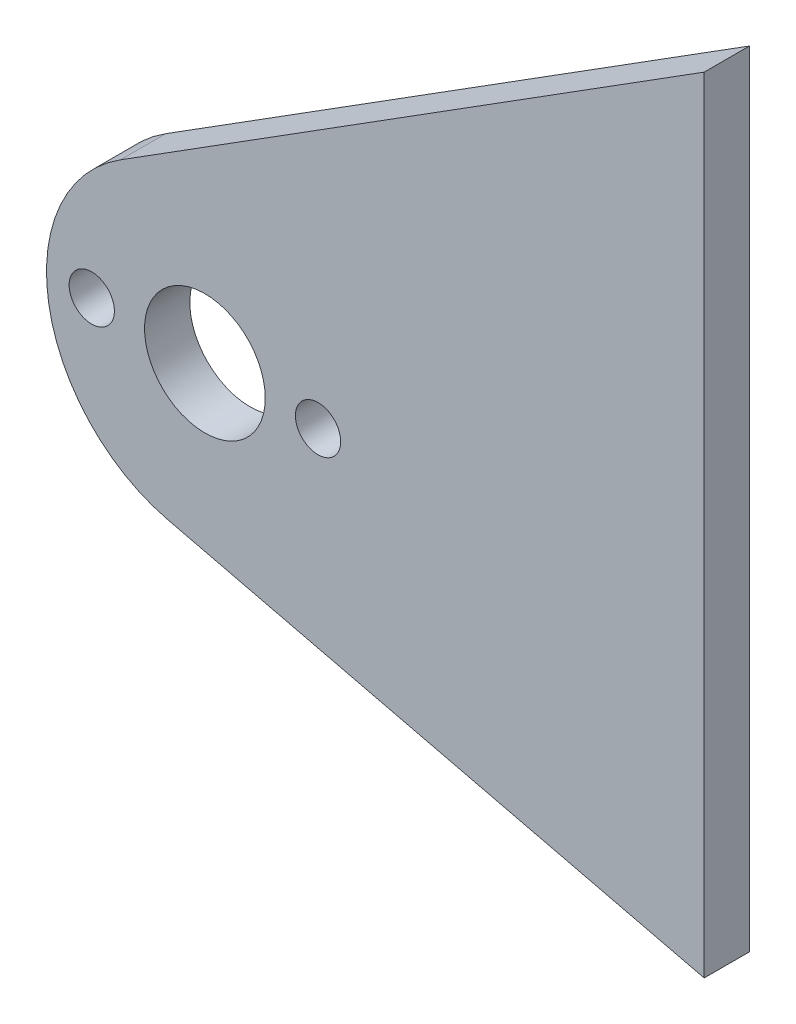
ISO-10303-21;
HEADER;
FILE_DESCRIPTION(('STEP AP214'),'2;1');
FILE_NAME('part.step','',(''),(''),'','','');
FILE_SCHEMA(('AUTOMOTIVE_DESIGN { 1 0 10303 214 1 1 1 1 }'));
ENDSEC;
DATA;
#1=APPLICATION_CONTEXT('core data for automotive mechanical design processes');
#2=APPLICATION_PROTOCOL_DEFINITION('international standard','automotive_design',2000,#1);
#3=PRODUCT_CONTEXT('',#1,'mechanical');
#4=PRODUCT('Part','Part','',(#3));
#5=PRODUCT_RELATED_PRODUCT_CATEGORY('part','',(#4));
#6=PRODUCT_DEFINITION_FORMATION('','',#4);
#7=PRODUCT_DEFINITION_CONTEXT('part definition',#1,'design');
#8=PRODUCT_DEFINITION('design','',#6,#7);
#9=PRODUCT_DEFINITION_SHAPE('','',#8);
#10=(LENGTH_UNIT() NAMED_UNIT(*) SI_UNIT(.MILLI.,.METRE.));
#11=(NAMED_UNIT(*) PLANE_ANGLE_UNIT() SI_UNIT($,.RADIAN.));
#12=(NAMED_UNIT(*) SI_UNIT($,.STERADIAN.) SOLID_ANGLE_UNIT());
#13=UNCERTAINTY_MEASURE_WITH_UNIT(LENGTH_MEASURE(1.E-05),#10,'distance_accuracy_value','');
#14=(GEOMETRIC_REPRESENTATION_CONTEXT(3) GLOBAL_UNCERTAINTY_ASSIGNED_CONTEXT((#13)) GLOBAL_UNIT_ASSIGNED_CONTEXT((#10,
#11,#12)) REPRESENTATION_CONTEXT('',''));
#15=CARTESIAN_POINT('',(0.,0.,0.));
#16=DIRECTION('',(0.,0.,1.));
#17=DIRECTION('',(1.,0.,0.));
#18=AXIS2_PLACEMENT_3D('',#15,#16,#17);
#19=CARTESIAN_POINT('',(-2.13222436464715,-8.88641442107344,3.));
#20=DIRECTION('',(-0.233319657242262,-0.972400091291827,0.));
#21=DIRECTION('',(0.972400091291827,-0.233319657242262,0.));
#22=AXIS2_PLACEMENT_3D('',#19,#20,#21);
#23=PLANE('',#22);
#24=DIRECTION('',(-0.972400091291827,0.233319657242262,0.));
#25=VECTOR('',#24,1.);
#26=CARTESIAN_POINT('',(-2.13222436464715,-8.88641442107344,0.));
#27=LINE('',#26,#25);
#28=CARTESIAN_POINT('',(33.092598,-17.33833,0.));
#29=VERTEX_POINT('',#28);
#30=CARTESIAN_POINT('',(-2.449857,-8.81020099999999,0.));
#31=VERTEX_POINT('',#30);
#32=EDGE_CURVE('E110',#29,#31,#27,.T.);
#33=ORIENTED_EDGE('',*,*,#32,.F.);
#34=DIRECTION('',(0.,0.,-1.));
#35=VECTOR('',#34,1.);
#36=CARTESIAN_POINT('',(33.092598,-17.33833,3.));
#37=LINE('',#36,#35);
#38=CARTESIAN_POINT('',(33.092598,-17.33833,3.));
#39=VERTEX_POINT('',#38);
#40=EDGE_CURVE('E11',#39,#29,#37,.T.);
#41=ORIENTED_EDGE('',*,*,#40,.F.);
#42=DIRECTION('',(-0.972400091291827,0.233319657242262,0.));
#43=VECTOR('',#42,1.);
#44=CARTESIAN_POINT('',(-2.13222436464715,-8.88641442107344,3.));
#45=LINE('',#44,#43);
#46=CARTESIAN_POINT('',(-2.449857,-8.81020099999999,3.));
#47=VERTEX_POINT('',#46);
#48=EDGE_CURVE('E94',#39,#47,#45,.T.);
#49=ORIENTED_EDGE('',*,*,#48,.T.);
#50=DIRECTION('',(0.,0.,-1.));
#51=VECTOR('',#50,1.);
#52=CARTESIAN_POINT('',(-2.449857,-8.81020099999999,3.));
#53=LINE('',#52,#51);
#54=EDGE_CURVE('E72',#47,#31,#53,.T.);
#55=ORIENTED_EDGE('',*,*,#54,.T.);
#56=EDGE_LOOP('',(#33,#41,#49,#55));
#57=FACE_BOUND('',#56,.T.);
#58=ADVANCED_FACE('F32',(#57),#23,.T.);
#59=CARTESIAN_POINT('',(33.092598,0.,3.));
#60=DIRECTION('',(1.,0.,0.));
#61=DIRECTION('',(0.,0.,-1.));
#62=AXIS2_PLACEMENT_3D('',#59,#60,#61);
#63=PLANE('',#62);
#64=DIRECTION('',(0.,-1.,0.));
#65=VECTOR('',#64,1.);
#66=CARTESIAN_POINT('',(33.092598,0.,0.));
#67=LINE('',#66,#65);
#68=CARTESIAN_POINT('',(33.092598,34.66167,0.));
#69=VERTEX_POINT('',#68);
#70=EDGE_CURVE('E84',#69,#29,#67,.T.);
#71=ORIENTED_EDGE('',*,*,#70,.F.);
#72=DIRECTION('',(0.,0.,-1.));
#73=VECTOR('',#72,1.);
#74=CARTESIAN_POINT('',(33.092598,34.66167,3.));
#75=LINE('',#74,#73);
#76=CARTESIAN_POINT('',(33.092598,34.66167,3.));
#77=VERTEX_POINT('',#76);
#78=EDGE_CURVE('E41',#77,#69,#75,.T.);
#79=ORIENTED_EDGE('',*,*,#78,.F.);
#80=DIRECTION('',(0.,-1.,0.));
#81=VECTOR('',#80,1.);
#82=CARTESIAN_POINT('',(33.092598,0.,3.));
#83=LINE('',#82,#81);
#84=EDGE_CURVE('E82',#77,#39,#83,.T.);
#85=ORIENTED_EDGE('',*,*,#84,.T.);
#86=ORIENTED_EDGE('',*,*,#40,.T.);
#87=EDGE_LOOP('',(#71,#79,#85,#86));
#88=FACE_BOUND('',#87,.T.);
#89=ADVANCED_FACE('F80',(#88),#63,.T.);
#90=CARTESIAN_POINT('',(-6.22887778180823,9.88575777058124,3.));
#91=DIRECTION('',(0.533089755805375,-0.846058693150402,0.));
#92=DIRECTION('',(0.846058693150402,0.533089755805375,0.));
#93=AXIS2_PLACEMENT_3D('',#90,#91,#92);
#94=PLANE('',#93);
#95=DIRECTION('',(-0.846058693150402,-0.533089755805375,0.));
#96=VECTOR('',#95,1.);
#97=CARTESIAN_POINT('',(-6.22887778180823,9.88575777058124,0.));
#98=LINE('',#97,#96);
#99=CARTESIAN_POINT('',(-5.59744300000001,10.283616,0.));
#100=VERTEX_POINT('',#99);
#101=EDGE_CURVE('E113',#69,#100,#98,.T.);
#102=ORIENTED_EDGE('',*,*,#101,.T.);
#103=DIRECTION('',(0.,0.,-1.));
#104=VECTOR('',#103,1.);
#105=CARTESIAN_POINT('',(-5.59744300000001,10.283616,3.));
#106=LINE('',#105,#104);
#107=CARTESIAN_POINT('',(-5.59744300000001,10.283616,3.));
#108=VERTEX_POINT('',#107);
#109=EDGE_CURVE('E87',#108,#100,#106,.T.);
#110=ORIENTED_EDGE('',*,*,#109,.F.);
#111=DIRECTION('',(-0.846058693150402,-0.533089755805375,0.));
#112=VECTOR('',#111,1.);
#113=CARTESIAN_POINT('',(-6.22887778180823,9.88575777058124,3.));
#114=LINE('',#113,#112);
#115=EDGE_CURVE('E89',#77,#108,#114,.T.);
#116=ORIENTED_EDGE('',*,*,#115,.F.);
#117=ORIENTED_EDGE('',*,*,#78,.T.);
#118=EDGE_LOOP('',(#102,#110,#116,#117));
#119=FACE_BOUND('',#118,.T.);
#120=ADVANCED_FACE('F90',(#119),#94,.F.);
#121=CARTESIAN_POINT('',(-7.50000000000001,1.39999999999998,3.));
#122=DIRECTION('',(0.,0.,-1.));
#123=DIRECTION('',(-1.,0.,0.));
#124=AXIS2_PLACEMENT_3D('',#121,#122,#123);
#125=CYLINDRICAL_SURFACE('',#124,1.5);
#126=CARTESIAN_POINT('',(-7.50000000000001,1.39999999999998,3.));
#127=DIRECTION('',(0.,0.,1.));
#128=DIRECTION('',(1.,0.,0.));
#129=AXIS2_PLACEMENT_3D('',#126,#127,#128);
#130=CIRCLE('',#129,1.5);
#131=CARTESIAN_POINT('',(-6.00000000000001,1.39999999999998,3.));
#132=VERTEX_POINT('',#131);
#133=EDGE_CURVE('E101',#132,#132,#130,.T.);
#134=ORIENTED_EDGE('',*,*,#133,.T.);
#135=EDGE_LOOP('',(#134));
#136=FACE_BOUND('',#135,.T.);
#137=CARTESIAN_POINT('',(-7.50000000000001,1.39999999999998,0.));
#138=DIRECTION('',(0.,0.,1.));
#139=DIRECTION('',(1.,0.,0.));
#140=AXIS2_PLACEMENT_3D('',#137,#138,#139);
#141=CIRCLE('',#140,1.5);
#142=CARTESIAN_POINT('',(-6.00000000000001,1.39999999999998,0.));
#143=VERTEX_POINT('',#142);
#144=EDGE_CURVE('E116',#143,#143,#141,.T.);
#145=ORIENTED_EDGE('',*,*,#144,.F.);
#146=EDGE_LOOP('',(#145));
#147=FACE_BOUND('',#146,.T.);
#148=ADVANCED_FACE('F135',(#136,#147),#125,.F.);
#149=CARTESIAN_POINT('',(-3.01676850167354E-07,1.39999988723435,3.));
#150=DIRECTION('',(0.,0.,-1.));
#151=DIRECTION('',(-1.,0.,0.));
#152=AXIS2_PLACEMENT_3D('',#149,#150,#151);
#153=CYLINDRICAL_SURFACE('',#152,10.5);
#154=CARTESIAN_POINT('',(-3.01676850167354E-07,1.39999988723435,0.));
#155=DIRECTION('',(0.,0.,1.));
#156=DIRECTION('',(1.,0.,0.));
#157=AXIS2_PLACEMENT_3D('',#154,#155,#156);
#158=CIRCLE('',#157,10.5);
#159=EDGE_CURVE('E65',#100,#31,#158,.T.);
#160=ORIENTED_EDGE('',*,*,#159,.T.);
#161=ORIENTED_EDGE('',*,*,#54,.F.);
#162=CARTESIAN_POINT('',(-3.01676850167354E-07,1.39999988723435,3.));
#163=DIRECTION('',(0.,0.,1.));
#164=DIRECTION('',(1.,0.,0.));
#165=AXIS2_PLACEMENT_3D('',#162,#163,#164);
#166=CIRCLE('',#165,10.5);
#167=EDGE_CURVE('E49',#108,#47,#166,.T.);
#168=ORIENTED_EDGE('',*,*,#167,.F.);
#169=ORIENTED_EDGE('',*,*,#109,.T.);
#170=EDGE_LOOP('',(#160,#161,#168,#169));
#171=FACE_BOUND('',#170,.T.);
#172=ADVANCED_FACE('F124',(#171),#153,.T.);
#173=CARTESIAN_POINT('',(7.50000000000001,1.39999999999998,3.));
#174=DIRECTION('',(0.,0.,-1.));
#175=DIRECTION('',(-1.,0.,0.));
#176=AXIS2_PLACEMENT_3D('',#173,#174,#175);
#177=CYLINDRICAL_SURFACE('',#176,1.5);
#178=CARTESIAN_POINT('',(7.50000000000001,1.39999999999998,3.));
#179=DIRECTION('',(0.,0.,1.));
#180=DIRECTION('',(1.,0.,0.));
#181=AXIS2_PLACEMENT_3D('',#178,#179,#180);
#182=CIRCLE('',#181,1.5);
#183=CARTESIAN_POINT('',(9.00000000000001,1.39999999999998,3.));
#184=VERTEX_POINT('',#183);
#185=EDGE_CURVE('E96',#184,#184,#182,.T.);
#186=ORIENTED_EDGE('',*,*,#185,.T.);
#187=EDGE_LOOP('',(#186));
#188=FACE_BOUND('',#187,.T.);
#189=CARTESIAN_POINT('',(7.50000000000001,1.39999999999998,0.));
#190=DIRECTION('',(0.,0.,1.));
#191=DIRECTION('',(1.,0.,0.));
#192=AXIS2_PLACEMENT_3D('',#189,#190,#191);
#193=CIRCLE('',#192,1.5);
#194=CARTESIAN_POINT('',(9.00000000000001,1.39999999999998,0.));
#195=VERTEX_POINT('',#194);
#196=EDGE_CURVE('E107',#195,#195,#193,.T.);
#197=ORIENTED_EDGE('',*,*,#196,.F.);
#198=EDGE_LOOP('',(#197));
#199=FACE_BOUND('',#198,.T.);
#200=ADVANCED_FACE('F34',(#188,#199),#177,.F.);
#201=CARTESIAN_POINT('',(-3.01676850167354E-07,1.39999988723435,3.));
#202=DIRECTION('',(0.,0.,-1.));
#203=DIRECTION('',(-1.,0.,0.));
#204=AXIS2_PLACEMENT_3D('',#201,#202,#203);
#205=CYLINDRICAL_SURFACE('',#204,4.00000030167686);
#206=CARTESIAN_POINT('',(-3.01676850167354E-07,1.39999988723435,3.));
#207=DIRECTION('',(0.,0.,1.));
#208=DIRECTION('',(1.,0.,0.));
#209=AXIS2_PLACEMENT_3D('',#206,#207,#208);
#210=CIRCLE('',#209,4.00000030167686);
#211=CARTESIAN_POINT('',(4.00000000000001,1.39999988723435,3.));
#212=VERTEX_POINT('',#211);
#213=EDGE_CURVE('E104',#212,#212,#210,.T.);
#214=ORIENTED_EDGE('',*,*,#213,.T.);
#215=EDGE_LOOP('',(#214));
#216=FACE_BOUND('',#215,.T.);
#217=CARTESIAN_POINT('',(-3.01676850167354E-07,1.39999988723435,0.));
#218=DIRECTION('',(0.,0.,1.));
#219=DIRECTION('',(1.,0.,0.));
#220=AXIS2_PLACEMENT_3D('',#217,#218,#219);
#221=CIRCLE('',#220,4.00000030167686);
#222=CARTESIAN_POINT('',(4.00000000000001,1.39999988723435,0.));
#223=VERTEX_POINT('',#222);
#224=EDGE_CURVE('E119',#223,#223,#221,.T.);
#225=ORIENTED_EDGE('',*,*,#224,.F.);
#226=EDGE_LOOP('',(#225));
#227=FACE_BOUND('',#226,.T.);
#228=ADVANCED_FACE('F141',(#216,#227),#205,.F.);
#229=CARTESIAN_POINT('',(0.,0.,3.));
#230=DIRECTION('',(0.,0.,1.));
#231=DIRECTION('',(1.,0.,0.));
#232=AXIS2_PLACEMENT_3D('',#229,#230,#231);
#233=PLANE('',#232);
#234=ORIENTED_EDGE('',*,*,#185,.F.);
#235=EDGE_LOOP('',(#234));
#236=FACE_BOUND('',#235,.T.);
#237=ORIENTED_EDGE('',*,*,#48,.F.);
#238=ORIENTED_EDGE('',*,*,#84,.F.);
#239=ORIENTED_EDGE('',*,*,#115,.T.);
#240=ORIENTED_EDGE('',*,*,#167,.T.);
#241=EDGE_LOOP('',(#237,#238,#239,#240));
#242=FACE_BOUND('',#241,.T.);
#243=ORIENTED_EDGE('',*,*,#133,.F.);
#244=EDGE_LOOP('',(#243));
#245=FACE_BOUND('',#244,.T.);
#246=ORIENTED_EDGE('',*,*,#213,.F.);
#247=EDGE_LOOP('',(#246));
#248=FACE_BOUND('',#247,.T.);
#249=ADVANCED_FACE('F92',(#236,#242,#245,#248),#233,.T.);
#250=CARTESIAN_POINT('',(0.,0.,0.));
#251=DIRECTION('',(0.,0.,1.));
#252=DIRECTION('',(1.,0.,0.));
#253=AXIS2_PLACEMENT_3D('',#250,#251,#252);
#254=PLANE('',#253);
#255=ORIENTED_EDGE('',*,*,#196,.T.);
#256=EDGE_LOOP('',(#255));
#257=FACE_BOUND('',#256,.T.);
#258=ORIENTED_EDGE('',*,*,#32,.T.);
#259=ORIENTED_EDGE('',*,*,#159,.F.);
#260=ORIENTED_EDGE('',*,*,#101,.F.);
#261=ORIENTED_EDGE('',*,*,#70,.T.);
#262=EDGE_LOOP('',(#258,#259,#260,#261));
#263=FACE_BOUND('',#262,.T.);
#264=ORIENTED_EDGE('',*,*,#144,.T.);
#265=EDGE_LOOP('',(#264));
#266=FACE_BOUND('',#265,.T.);
#267=ORIENTED_EDGE('',*,*,#224,.T.);
#268=EDGE_LOOP('',(#267));
#269=FACE_BOUND('',#268,.T.);
#270=ADVANCED_FACE('F125',(#257,#263,#266,#269),#254,.F.);
#271=CLOSED_SHELL('',(#58,#89,#120,#148,#172,#200,#228,#249,#270));
#272=MANIFOLD_SOLID_BREP('B2',#271);
#273=ADVANCED_BREP_SHAPE_REPRESENTATION('',(#18,#272),#14);
#274=SHAPE_DEFINITION_REPRESENTATION(#9,#273);
ENDSEC;
END-ISO-10303-21;
